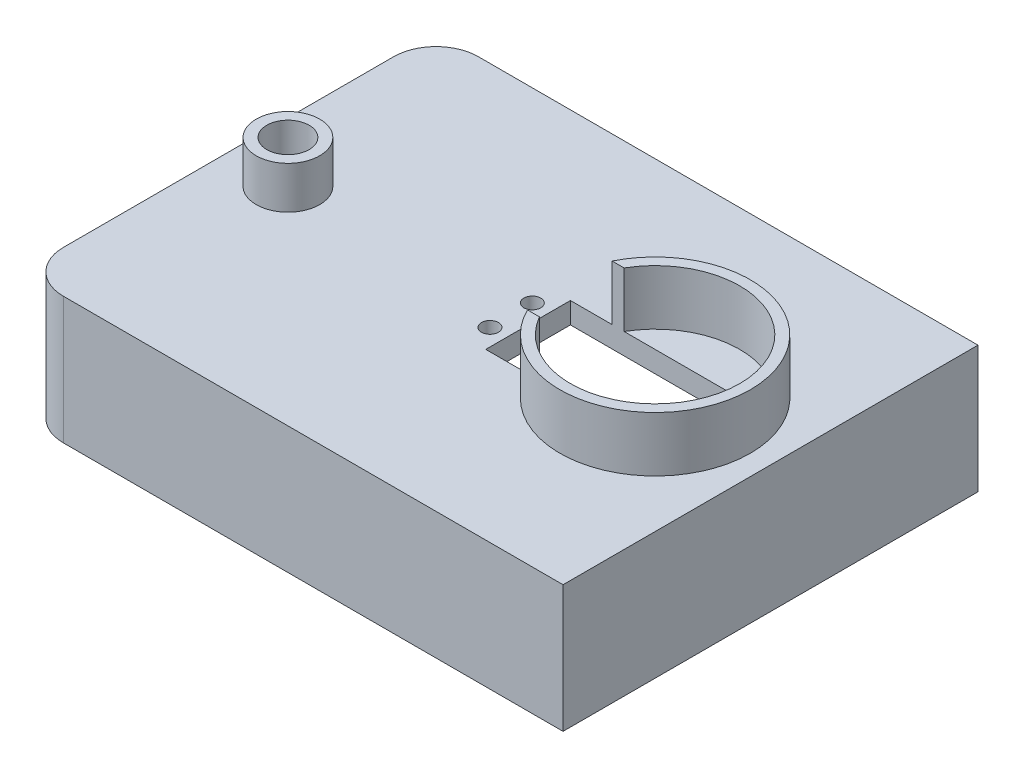
ISO-10303-21;
HEADER;
FILE_DESCRIPTION(('STEP AP214'),'2;1');
FILE_NAME('part.step','',(''),(''),'','','');
FILE_SCHEMA(('AUTOMOTIVE_DESIGN { 1 0 10303 214 1 1 1 1 }'));
ENDSEC;
DATA;
#1=APPLICATION_CONTEXT('core data for automotive mechanical design processes');
#2=APPLICATION_PROTOCOL_DEFINITION('international standard','automotive_design',2000,#1);
#3=PRODUCT_CONTEXT('',#1,'mechanical');
#4=PRODUCT('Part','Part','',(#3));
#5=PRODUCT_RELATED_PRODUCT_CATEGORY('part','',(#4));
#6=PRODUCT_DEFINITION_FORMATION('','',#4);
#7=PRODUCT_DEFINITION_CONTEXT('part definition',#1,'design');
#8=PRODUCT_DEFINITION('design','',#6,#7);
#9=PRODUCT_DEFINITION_SHAPE('','',#8);
#10=(LENGTH_UNIT() NAMED_UNIT(*) SI_UNIT(.MILLI.,.METRE.));
#11=(NAMED_UNIT(*) PLANE_ANGLE_UNIT() SI_UNIT($,.RADIAN.));
#12=(NAMED_UNIT(*) SI_UNIT($,.STERADIAN.) SOLID_ANGLE_UNIT());
#13=UNCERTAINTY_MEASURE_WITH_UNIT(LENGTH_MEASURE(1.E-05),#10,'distance_accuracy_value','');
#14=(GEOMETRIC_REPRESENTATION_CONTEXT(3) GLOBAL_UNCERTAINTY_ASSIGNED_CONTEXT((#13)) GLOBAL_UNIT_ASSIGNED_CONTEXT((#10,
#11,#12)) REPRESENTATION_CONTEXT('',''));
#15=CARTESIAN_POINT('',(0.,0.,0.));
#16=DIRECTION('',(0.,0.,1.));
#17=DIRECTION('',(1.,0.,0.));
#18=AXIS2_PLACEMENT_3D('',#15,#16,#17);
#19=CARTESIAN_POINT('',(0.,30.,0.));
#20=DIRECTION('',(0.,1.,0.));
#21=DIRECTION('',(0.,0.,1.));
#22=AXIS2_PLACEMENT_3D('',#19,#20,#21);
#23=PLANE('',#22);
#24=DIRECTION('',(-1.,0.,0.));
#25=VECTOR('',#24,1.);
#26=CARTESIAN_POINT('',(-64.,30.,-49.));
#27=LINE('',#26,#25);
#28=CARTESIAN_POINT('',(64.,30.,-49.));
#29=VERTEX_POINT('',#28);
#30=CARTESIAN_POINT('',(-54.,30.,-49.));
#31=VERTEX_POINT('',#30);
#32=EDGE_CURVE('E267',#29,#31,#27,.T.);
#33=ORIENTED_EDGE('',*,*,#32,.T.);
#34=CARTESIAN_POINT('',(-54.,30.,-39.));
#35=DIRECTION('',(0.,1.,0.));
#36=DIRECTION('',(0.,0.,1.));
#37=AXIS2_PLACEMENT_3D('',#34,#35,#36);
#38=CIRCLE('',#37,10.);
#39=CARTESIAN_POINT('',(-64.,30.,-39.));
#40=VERTEX_POINT('',#39);
#41=EDGE_CURVE('E52',#31,#40,#38,.T.);
#42=ORIENTED_EDGE('',*,*,#41,.T.);
#43=DIRECTION('',(0.,0.,1.));
#44=VECTOR('',#43,1.);
#45=CARTESIAN_POINT('',(-64.,30.,-49.));
#46=LINE('',#45,#44);
#47=CARTESIAN_POINT('',(-64.,30.,39.));
#48=VERTEX_POINT('',#47);
#49=EDGE_CURVE('E271',#40,#48,#46,.T.);
#50=ORIENTED_EDGE('',*,*,#49,.T.);
#51=CARTESIAN_POINT('',(-54.,30.,39.));
#52=DIRECTION('',(0.,1.,0.));
#53=DIRECTION('',(0.,0.,1.));
#54=AXIS2_PLACEMENT_3D('',#51,#52,#53);
#55=CIRCLE('',#54,10.);
#56=CARTESIAN_POINT('',(-54.,30.,49.));
#57=VERTEX_POINT('',#56);
#58=EDGE_CURVE('E316',#48,#57,#55,.T.);
#59=ORIENTED_EDGE('',*,*,#58,.T.);
#60=DIRECTION('',(1.,0.,0.));
#61=VECTOR('',#60,1.);
#62=CARTESIAN_POINT('',(-64.,30.,49.));
#63=LINE('',#62,#61);
#64=CARTESIAN_POINT('',(64.,30.,49.));
#65=VERTEX_POINT('',#64);
#66=EDGE_CURVE('E274',#57,#65,#63,.T.);
#67=ORIENTED_EDGE('',*,*,#66,.T.);
#68=DIRECTION('',(0.,0.,-1.));
#69=VECTOR('',#68,1.);
#70=CARTESIAN_POINT('',(64.,30.,-49.));
#71=LINE('',#70,#69);
#72=EDGE_CURVE('E264',#65,#29,#71,.T.);
#73=ORIENTED_EDGE('',*,*,#72,.T.);
#74=EDGE_LOOP('',(#33,#42,#50,#59,#67,#73));
#75=FACE_BOUND('',#74,.T.);
#76=CARTESIAN_POINT('',(2.74010104788201,30.,-5.00000000000001));
#77=DIRECTION('',(0.,1.,0.));
#78=DIRECTION('',(0.,0.,1.));
#79=AXIS2_PLACEMENT_3D('',#76,#77,#78);
#80=CIRCLE('',#79,2.);
#81=CARTESIAN_POINT('',(2.74010104788201,30.,-3.00000000000001));
#82=VERTEX_POINT('',#81);
#83=EDGE_CURVE('E197',#82,#82,#80,.T.);
#84=ORIENTED_EDGE('',*,*,#83,.F.);
#85=EDGE_LOOP('',(#84));
#86=FACE_BOUND('',#85,.T.);
#87=CARTESIAN_POINT('',(2.74010104788201,30.,4.99999999999999));
#88=DIRECTION('',(0.,1.,0.));
#89=DIRECTION('',(0.,0.,1.));
#90=AXIS2_PLACEMENT_3D('',#87,#88,#89);
#91=CIRCLE('',#90,2.);
#92=CARTESIAN_POINT('',(2.74010104788201,30.,6.99999999999999));
#93=VERTEX_POINT('',#92);
#94=EDGE_CURVE('E194',#93,#93,#91,.T.);
#95=ORIENTED_EDGE('',*,*,#94,.F.);
#96=EDGE_LOOP('',(#95));
#97=FACE_BOUND('',#96,.T.);
#98=CARTESIAN_POINT('',(36.740101047882,30.,0.));
#99=DIRECTION('',(0.,1.,0.));
#100=DIRECTION('',(0.,0.,1.));
#101=AXIS2_PLACEMENT_3D('',#98,#99,#100);
#102=CIRCLE('',#101,22.5);
#103=CARTESIAN_POINT('',(16.5844566771357,30.,10.));
#104=VERTEX_POINT('',#103);
#105=CARTESIAN_POINT('',(16.5844566771356,30.,-10.));
#106=VERTEX_POINT('',#105);
#107=EDGE_CURVE('E68',#104,#106,#102,.T.);
#108=ORIENTED_EDGE('',*,*,#107,.F.);
#109=DIRECTION('',(1.,0.,0.));
#110=VECTOR('',#109,1.);
#111=CARTESIAN_POINT('',(6.74010104788201,30.,10.));
#112=LINE('',#111,#110);
#113=CARTESIAN_POINT('',(6.74010104788201,30.,10.));
#114=VERTEX_POINT('',#113);
#115=EDGE_CURVE('E215',#114,#104,#112,.T.);
#116=ORIENTED_EDGE('',*,*,#115,.F.);
#117=DIRECTION('',(0.,0.,1.));
#118=VECTOR('',#117,1.);
#119=CARTESIAN_POINT('',(6.74010104788201,30.,-10.));
#120=LINE('',#119,#118);
#121=CARTESIAN_POINT('',(6.74010104788201,30.,-10.));
#122=VERTEX_POINT('',#121);
#123=EDGE_CURVE('E212',#122,#114,#120,.T.);
#124=ORIENTED_EDGE('',*,*,#123,.F.);
#125=DIRECTION('',(-1.,0.,0.));
#126=VECTOR('',#125,1.);
#127=CARTESIAN_POINT('',(6.74010104788201,30.,-10.));
#128=LINE('',#127,#126);
#129=EDGE_CURVE('E220',#106,#122,#128,.T.);
#130=ORIENTED_EDGE('',*,*,#129,.F.);
#131=EDGE_LOOP('',(#108,#116,#124,#130));
#132=FACE_BOUND('',#131,.T.);
#133=CARTESIAN_POINT('',(-49.9721682107591,30.,0.));
#134=DIRECTION('',(0.,1.,0.));
#135=DIRECTION('',(0.,0.,1.));
#136=AXIS2_PLACEMENT_3D('',#133,#134,#135);
#137=CIRCLE('',#136,7.5);
#138=CARTESIAN_POINT('',(-49.9721682107591,30.,7.5));
#139=VERTEX_POINT('',#138);
#140=EDGE_CURVE('E637',#139,#139,#137,.T.);
#141=ORIENTED_EDGE('',*,*,#140,.F.);
#142=EDGE_LOOP('',(#141));
#143=FACE_BOUND('',#142,.T.);
#144=ADVANCED_FACE('F43',(#75,#86,#97,#132,#143),#23,.T.);
#145=CARTESIAN_POINT('',(36.740101047882,30.,0.));
#146=DIRECTION('',(0.,-1.,0.));
#147=DIRECTION('',(0.,0.,1.));
#148=AXIS2_PLACEMENT_3D('',#145,#146,#147);
#149=CIRCLE('',#148,20.);
#150=CARTESIAN_POINT('',(19.4195929721932,30.,-10.));
#151=VERTEX_POINT('',#150);
#152=CARTESIAN_POINT('',(19.4195929721932,30.,10.));
#153=VERTEX_POINT('',#152);
#154=EDGE_CURVE('E193',#151,#153,#149,.T.);
#155=ORIENTED_EDGE('',*,*,#154,.F.);
#156=CARTESIAN_POINT('',(46.740101047882,30.,-10.));
#157=VERTEX_POINT('',#156);
#158=EDGE_CURVE('E221',#157,#151,#128,.T.);
#159=ORIENTED_EDGE('',*,*,#158,.F.);
#160=DIRECTION('',(0.,0.,-1.));
#161=VECTOR('',#160,1.);
#162=CARTESIAN_POINT('',(46.740101047882,30.,-10.));
#163=LINE('',#162,#161);
#164=CARTESIAN_POINT('',(46.740101047882,30.,10.));
#165=VERTEX_POINT('',#164);
#166=EDGE_CURVE('E217',#165,#157,#163,.T.);
#167=ORIENTED_EDGE('',*,*,#166,.F.);
#168=EDGE_CURVE('E60',#153,#165,#112,.T.);
#169=ORIENTED_EDGE('',*,*,#168,.F.);
#170=EDGE_LOOP('',(#155,#159,#167,#169));
#171=FACE_BOUND('',#170,.T.);
#172=CARTESIAN_POINT('',(50.740101047882,30.,4.99999999999999));
#173=DIRECTION('',(0.,1.,0.));
#174=DIRECTION('',(0.,0.,1.));
#175=AXIS2_PLACEMENT_3D('',#172,#173,#174);
#176=CIRCLE('',#175,2.);
#177=CARTESIAN_POINT('',(50.740101047882,30.,6.99999999999999));
#178=VERTEX_POINT('',#177);
#179=EDGE_CURVE('E206',#178,#178,#176,.T.);
#180=ORIENTED_EDGE('',*,*,#179,.F.);
#181=EDGE_LOOP('',(#180));
#182=FACE_BOUND('',#181,.T.);
#183=CARTESIAN_POINT('',(50.740101047882,30.,-5.00000000000001));
#184=DIRECTION('',(0.,1.,0.));
#185=DIRECTION('',(0.,0.,1.));
#186=AXIS2_PLACEMENT_3D('',#183,#184,#185);
#187=CIRCLE('',#186,2.);
#188=CARTESIAN_POINT('',(50.740101047882,30.,-3.));
#189=VERTEX_POINT('',#188);
#190=EDGE_CURVE('E203',#189,#189,#187,.T.);
#191=ORIENTED_EDGE('',*,*,#190,.F.);
#192=EDGE_LOOP('',(#191));
#193=FACE_BOUND('',#192,.T.);
#194=ADVANCED_FACE('F348',(#171,#182,#193),#23,.T.);
#195=CARTESIAN_POINT('',(59.,30.,-44.));
#196=DIRECTION('',(-1.,0.,0.));
#197=DIRECTION('',(0.,0.,1.));
#198=AXIS2_PLACEMENT_3D('',#195,#196,#197);
#199=PLANE('',#198);
#200=DIRECTION('',(0.,-1.,0.));
#201=VECTOR('',#200,1.);
#202=CARTESIAN_POINT('',(59.,30.,44.));
#203=LINE('',#202,#201);
#204=CARTESIAN_POINT('',(59.,25.,44.));
#205=VERTEX_POINT('',#204);
#206=CARTESIAN_POINT('',(59.,0.,44.));
#207=VERTEX_POINT('',#206);
#208=EDGE_CURVE('E255',#205,#207,#203,.T.);
#209=ORIENTED_EDGE('',*,*,#208,.F.);
#210=DIRECTION('',(0.,0.,-1.));
#211=VECTOR('',#210,1.);
#212=CARTESIAN_POINT('',(59.,25.,-44.));
#213=LINE('',#212,#211);
#214=CARTESIAN_POINT('',(59.,25.,-44.));
#215=VERTEX_POINT('',#214);
#216=EDGE_CURVE('E240',#205,#215,#213,.T.);
#217=ORIENTED_EDGE('',*,*,#216,.T.);
#218=DIRECTION('',(0.,-1.,0.));
#219=VECTOR('',#218,1.);
#220=CARTESIAN_POINT('',(59.,30.,-44.));
#221=LINE('',#220,#219);
#222=CARTESIAN_POINT('',(59.,0.,-44.));
#223=VERTEX_POINT('',#222);
#224=EDGE_CURVE('E261',#215,#223,#221,.T.);
#225=ORIENTED_EDGE('',*,*,#224,.T.);
#226=DIRECTION('',(0.,0.,-1.));
#227=VECTOR('',#226,1.);
#228=CARTESIAN_POINT('',(59.,0.,-44.));
#229=LINE('',#228,#227);
#230=EDGE_CURVE('E243',#207,#223,#229,.T.);
#231=ORIENTED_EDGE('',*,*,#230,.F.);
#232=EDGE_LOOP('',(#209,#217,#225,#231));
#233=FACE_BOUND('',#232,.T.);
#234=ADVANCED_FACE('F355',(#233),#199,.T.);
#235=CARTESIAN_POINT('',(-59.,30.,-44.));
#236=DIRECTION('',(0.,0.,1.));
#237=DIRECTION('',(1.,0.,0.));
#238=AXIS2_PLACEMENT_3D('',#235,#236,#237);
#239=PLANE('',#238);
#240=ORIENTED_EDGE('',*,*,#224,.F.);
#241=DIRECTION('',(-1.,0.,0.));
#242=VECTOR('',#241,1.);
#243=CARTESIAN_POINT('',(-59.,25.,-44.));
#244=LINE('',#243,#242);
#245=CARTESIAN_POINT('',(-59.,25.,-44.));
#246=VERTEX_POINT('',#245);
#247=EDGE_CURVE('E237',#215,#246,#244,.T.);
#248=ORIENTED_EDGE('',*,*,#247,.T.);
#249=DIRECTION('',(0.,-1.,0.));
#250=VECTOR('',#249,1.);
#251=CARTESIAN_POINT('',(-59.,30.,-44.));
#252=LINE('',#251,#250);
#253=CARTESIAN_POINT('',(-59.,0.,-44.));
#254=VERTEX_POINT('',#253);
#255=EDGE_CURVE('E259',#246,#254,#252,.T.);
#256=ORIENTED_EDGE('',*,*,#255,.T.);
#257=DIRECTION('',(-1.,0.,0.));
#258=VECTOR('',#257,1.);
#259=CARTESIAN_POINT('',(-59.,0.,-44.));
#260=LINE('',#259,#258);
#261=EDGE_CURVE('E246',#223,#254,#260,.T.);
#262=ORIENTED_EDGE('',*,*,#261,.F.);
#263=EDGE_LOOP('',(#240,#248,#256,#262));
#264=FACE_BOUND('',#263,.T.);
#265=ADVANCED_FACE('F414',(#264),#239,.T.);
#266=CARTESIAN_POINT('',(-59.,30.,-44.));
#267=DIRECTION('',(1.,0.,0.));
#268=DIRECTION('',(0.,0.,-1.));
#269=AXIS2_PLACEMENT_3D('',#266,#267,#268);
#270=PLANE('',#269);
#271=ORIENTED_EDGE('',*,*,#255,.F.);
#272=DIRECTION('',(0.,0.,1.));
#273=VECTOR('',#272,1.);
#274=CARTESIAN_POINT('',(-59.,25.,-44.));
#275=LINE('',#274,#273);
#276=CARTESIAN_POINT('',(-59.,25.,44.));
#277=VERTEX_POINT('',#276);
#278=EDGE_CURVE('E228',#246,#277,#275,.T.);
#279=ORIENTED_EDGE('',*,*,#278,.T.);
#280=DIRECTION('',(0.,-1.,0.));
#281=VECTOR('',#280,1.);
#282=CARTESIAN_POINT('',(-59.,30.,44.));
#283=LINE('',#282,#281);
#284=CARTESIAN_POINT('',(-59.,0.,44.));
#285=VERTEX_POINT('',#284);
#286=EDGE_CURVE('E257',#277,#285,#283,.T.);
#287=ORIENTED_EDGE('',*,*,#286,.T.);
#288=DIRECTION('',(0.,0.,1.));
#289=VECTOR('',#288,1.);
#290=CARTESIAN_POINT('',(-59.,0.,-44.));
#291=LINE('',#290,#289);
#292=EDGE_CURVE('E249',#254,#285,#291,.T.);
#293=ORIENTED_EDGE('',*,*,#292,.F.);
#294=EDGE_LOOP('',(#271,#279,#287,#293));
#295=FACE_BOUND('',#294,.T.);
#296=ADVANCED_FACE('F418',(#295),#270,.T.);
#297=CARTESIAN_POINT('',(-59.,30.,44.));
#298=DIRECTION('',(0.,0.,-1.));
#299=DIRECTION('',(-1.,0.,0.));
#300=AXIS2_PLACEMENT_3D('',#297,#298,#299);
#301=PLANE('',#300);
#302=ORIENTED_EDGE('',*,*,#286,.F.);
#303=DIRECTION('',(1.,0.,0.));
#304=VECTOR('',#303,1.);
#305=CARTESIAN_POINT('',(-59.,25.,44.));
#306=LINE('',#305,#304);
#307=EDGE_CURVE('E290',#277,#205,#306,.T.);
#308=ORIENTED_EDGE('',*,*,#307,.T.);
#309=ORIENTED_EDGE('',*,*,#208,.T.);
#310=DIRECTION('',(1.,0.,0.));
#311=VECTOR('',#310,1.);
#312=CARTESIAN_POINT('',(-59.,0.,44.));
#313=LINE('',#312,#311);
#314=EDGE_CURVE('E252',#285,#207,#313,.T.);
#315=ORIENTED_EDGE('',*,*,#314,.F.);
#316=EDGE_LOOP('',(#302,#308,#309,#315));
#317=FACE_BOUND('',#316,.T.);
#318=ADVANCED_FACE('F364',(#317),#301,.T.);
#319=CARTESIAN_POINT('',(0.,0.,0.));
#320=DIRECTION('',(0.,1.,0.));
#321=DIRECTION('',(0.,0.,1.));
#322=AXIS2_PLACEMENT_3D('',#319,#320,#321);
#323=PLANE('',#322);
#324=DIRECTION('',(0.,0.,1.));
#325=VECTOR('',#324,1.);
#326=CARTESIAN_POINT('',(-64.,0.,-49.));
#327=LINE('',#326,#325);
#328=CARTESIAN_POINT('',(-64.,0.,-39.));
#329=VERTEX_POINT('',#328);
#330=CARTESIAN_POINT('',(-64.,0.,39.));
#331=VERTEX_POINT('',#330);
#332=EDGE_CURVE('E282',#329,#331,#327,.T.);
#333=ORIENTED_EDGE('',*,*,#332,.F.);
#334=CARTESIAN_POINT('',(-54.,0.,-39.));
#335=DIRECTION('',(0.,1.,0.));
#336=DIRECTION('',(0.,0.,1.));
#337=AXIS2_PLACEMENT_3D('',#334,#335,#336);
#338=CIRCLE('',#337,10.);
#339=CARTESIAN_POINT('',(-54.,0.,-49.));
#340=VERTEX_POINT('',#339);
#341=EDGE_CURVE('E312',#329,#340,#338,.F.);
#342=ORIENTED_EDGE('',*,*,#341,.T.);
#343=DIRECTION('',(-1.,0.,0.));
#344=VECTOR('',#343,1.);
#345=CARTESIAN_POINT('',(-64.,0.,-49.));
#346=LINE('',#345,#344);
#347=CARTESIAN_POINT('',(64.,0.,-49.));
#348=VERTEX_POINT('',#347);
#349=EDGE_CURVE('E279',#348,#340,#346,.T.);
#350=ORIENTED_EDGE('',*,*,#349,.F.);
#351=DIRECTION('',(0.,0.,-1.));
#352=VECTOR('',#351,1.);
#353=CARTESIAN_POINT('',(64.,0.,-49.));
#354=LINE('',#353,#352);
#355=CARTESIAN_POINT('',(64.,0.,49.));
#356=VERTEX_POINT('',#355);
#357=EDGE_CURVE('E263',#356,#348,#354,.T.);
#358=ORIENTED_EDGE('',*,*,#357,.F.);
#359=DIRECTION('',(1.,0.,0.));
#360=VECTOR('',#359,1.);
#361=CARTESIAN_POINT('',(-64.,0.,49.));
#362=LINE('',#361,#360);
#363=CARTESIAN_POINT('',(-54.,0.,49.));
#364=VERTEX_POINT('',#363);
#365=EDGE_CURVE('E268',#364,#356,#362,.T.);
#366=ORIENTED_EDGE('',*,*,#365,.F.);
#367=CARTESIAN_POINT('',(-54.,0.,39.));
#368=DIRECTION('',(0.,1.,0.));
#369=DIRECTION('',(0.,0.,1.));
#370=AXIS2_PLACEMENT_3D('',#367,#368,#369);
#371=CIRCLE('',#370,10.);
#372=EDGE_CURVE('E310',#364,#331,#371,.F.);
#373=ORIENTED_EDGE('',*,*,#372,.T.);
#374=EDGE_LOOP('',(#333,#342,#350,#358,#366,#373));
#375=FACE_BOUND('',#374,.T.);
#376=ORIENTED_EDGE('',*,*,#230,.T.);
#377=ORIENTED_EDGE('',*,*,#261,.T.);
#378=ORIENTED_EDGE('',*,*,#292,.T.);
#379=ORIENTED_EDGE('',*,*,#314,.T.);
#380=EDGE_LOOP('',(#376,#377,#378,#379));
#381=FACE_BOUND('',#380,.T.);
#382=ADVANCED_FACE('F360',(#375,#381),#323,.F.);
#383=CARTESIAN_POINT('',(64.,30.,-49.));
#384=DIRECTION('',(-1.,0.,0.));
#385=DIRECTION('',(0.,0.,1.));
#386=AXIS2_PLACEMENT_3D('',#383,#384,#385);
#387=PLANE('',#386);
#388=DIRECTION('',(0.,-1.,0.));
#389=VECTOR('',#388,1.);
#390=CARTESIAN_POINT('',(64.,30.,49.));
#391=LINE('',#390,#389);
#392=EDGE_CURVE('E276',#65,#356,#391,.T.);
#393=ORIENTED_EDGE('',*,*,#392,.T.);
#394=ORIENTED_EDGE('',*,*,#357,.T.);
#395=DIRECTION('',(0.,-1.,0.));
#396=VECTOR('',#395,1.);
#397=CARTESIAN_POINT('',(64.,30.,-49.));
#398=LINE('',#397,#396);
#399=EDGE_CURVE('E288',#29,#348,#398,.T.);
#400=ORIENTED_EDGE('',*,*,#399,.F.);
#401=ORIENTED_EDGE('',*,*,#72,.F.);
#402=EDGE_LOOP('',(#393,#394,#400,#401));
#403=FACE_BOUND('',#402,.T.);
#404=ADVANCED_FACE('F363',(#403),#387,.F.);
#405=CARTESIAN_POINT('',(-64.,30.,-49.));
#406=DIRECTION('',(0.,0.,1.));
#407=DIRECTION('',(1.,0.,0.));
#408=AXIS2_PLACEMENT_3D('',#405,#406,#407);
#409=PLANE('',#408);
#410=ORIENTED_EDGE('',*,*,#349,.T.);
#411=DIRECTION('',(0.,-1.,0.));
#412=VECTOR('',#411,1.);
#413=CARTESIAN_POINT('',(-54.,30.,-49.));
#414=LINE('',#413,#412);
#415=EDGE_CURVE('E314',#340,#31,#414,.F.);
#416=ORIENTED_EDGE('',*,*,#415,.T.);
#417=ORIENTED_EDGE('',*,*,#32,.F.);
#418=ORIENTED_EDGE('',*,*,#399,.T.);
#419=EDGE_LOOP('',(#410,#416,#417,#418));
#420=FACE_BOUND('',#419,.T.);
#421=ADVANCED_FACE('F373',(#420),#409,.F.);
#422=CARTESIAN_POINT('',(-64.,30.,-49.));
#423=DIRECTION('',(1.,0.,0.));
#424=DIRECTION('',(0.,0.,-1.));
#425=AXIS2_PLACEMENT_3D('',#422,#423,#424);
#426=PLANE('',#425);
#427=ORIENTED_EDGE('',*,*,#49,.F.);
#428=DIRECTION('',(0.,-1.,0.));
#429=VECTOR('',#428,1.);
#430=CARTESIAN_POINT('',(-64.,30.,-39.));
#431=LINE('',#430,#429);
#432=EDGE_CURVE('E307',#40,#329,#431,.T.);
#433=ORIENTED_EDGE('',*,*,#432,.T.);
#434=ORIENTED_EDGE('',*,*,#332,.T.);
#435=DIRECTION('',(0.,-1.,0.));
#436=VECTOR('',#435,1.);
#437=CARTESIAN_POINT('',(-64.,30.,39.));
#438=LINE('',#437,#436);
#439=EDGE_CURVE('E305',#331,#48,#438,.F.);
#440=ORIENTED_EDGE('',*,*,#439,.T.);
#441=EDGE_LOOP('',(#427,#433,#434,#440));
#442=FACE_BOUND('',#441,.T.);
#443=ADVANCED_FACE('F369',(#442),#426,.F.);
#444=CARTESIAN_POINT('',(-64.,30.,49.));
#445=DIRECTION('',(0.,0.,-1.));
#446=DIRECTION('',(-1.,0.,0.));
#447=AXIS2_PLACEMENT_3D('',#444,#445,#446);
#448=PLANE('',#447);
#449=ORIENTED_EDGE('',*,*,#66,.F.);
#450=DIRECTION('',(0.,-1.,0.));
#451=VECTOR('',#450,1.);
#452=CARTESIAN_POINT('',(-54.,30.,49.));
#453=LINE('',#452,#451);
#454=EDGE_CURVE('E11',#57,#364,#453,.T.);
#455=ORIENTED_EDGE('',*,*,#454,.T.);
#456=ORIENTED_EDGE('',*,*,#365,.T.);
#457=ORIENTED_EDGE('',*,*,#392,.F.);
#458=EDGE_LOOP('',(#449,#455,#456,#457));
#459=FACE_BOUND('',#458,.T.);
#460=ADVANCED_FACE('F366',(#459),#448,.F.);
#461=CARTESIAN_POINT('',(0.,25.,0.));
#462=DIRECTION('',(0.,1.,0.));
#463=DIRECTION('',(0.,0.,1.));
#464=AXIS2_PLACEMENT_3D('',#461,#462,#463);
#465=PLANE('',#464);
#466=CARTESIAN_POINT('',(-49.9721682107591,25.,0.));
#467=DIRECTION('',(0.,1.,0.));
#468=DIRECTION('',(0.,0.,1.));
#469=AXIS2_PLACEMENT_3D('',#466,#467,#468);
#470=CIRCLE('',#469,5.);
#471=CARTESIAN_POINT('',(-49.9721682107591,25.,5.));
#472=VERTEX_POINT('',#471);
#473=EDGE_CURVE('E47',#472,#472,#470,.T.);
#474=ORIENTED_EDGE('',*,*,#473,.T.);
#475=EDGE_LOOP('',(#474));
#476=FACE_BOUND('',#475,.T.);
#477=CARTESIAN_POINT('',(2.74010104788201,25.,4.99999999999999));
#478=DIRECTION('',(0.,1.,0.));
#479=DIRECTION('',(0.,0.,1.));
#480=AXIS2_PLACEMENT_3D('',#477,#478,#479);
#481=CIRCLE('',#480,2.);
#482=CARTESIAN_POINT('',(2.74010104788201,25.,6.99999999999999));
#483=VERTEX_POINT('',#482);
#484=EDGE_CURVE('E214',#483,#483,#481,.T.);
#485=ORIENTED_EDGE('',*,*,#484,.T.);
#486=EDGE_LOOP('',(#485));
#487=FACE_BOUND('',#486,.T.);
#488=CARTESIAN_POINT('',(2.74010104788201,25.,-5.00000000000001));
#489=DIRECTION('',(0.,1.,0.));
#490=DIRECTION('',(0.,0.,1.));
#491=AXIS2_PLACEMENT_3D('',#488,#489,#490);
#492=CIRCLE('',#491,2.);
#493=CARTESIAN_POINT('',(2.74010104788201,25.,-3.00000000000001));
#494=VERTEX_POINT('',#493);
#495=EDGE_CURVE('E324',#494,#494,#492,.T.);
#496=ORIENTED_EDGE('',*,*,#495,.T.);
#497=EDGE_LOOP('',(#496));
#498=FACE_BOUND('',#497,.T.);
#499=CARTESIAN_POINT('',(50.740101047882,25.,-5.00000000000001));
#500=DIRECTION('',(0.,1.,0.));
#501=DIRECTION('',(0.,0.,1.));
#502=AXIS2_PLACEMENT_3D('',#499,#500,#501);
#503=CIRCLE('',#502,2.);
#504=CARTESIAN_POINT('',(50.740101047882,25.,-3.));
#505=VERTEX_POINT('',#504);
#506=EDGE_CURVE('E321',#505,#505,#503,.T.);
#507=ORIENTED_EDGE('',*,*,#506,.T.);
#508=EDGE_LOOP('',(#507));
#509=FACE_BOUND('',#508,.T.);
#510=CARTESIAN_POINT('',(50.740101047882,25.,4.99999999999999));
#511=DIRECTION('',(0.,1.,0.));
#512=DIRECTION('',(0.,0.,1.));
#513=AXIS2_PLACEMENT_3D('',#510,#511,#512);
#514=CIRCLE('',#513,2.);
#515=CARTESIAN_POINT('',(50.740101047882,25.,6.99999999999999));
#516=VERTEX_POINT('',#515);
#517=EDGE_CURVE('E211',#516,#516,#514,.T.);
#518=ORIENTED_EDGE('',*,*,#517,.T.);
#519=EDGE_LOOP('',(#518));
#520=FACE_BOUND('',#519,.T.);
#521=DIRECTION('',(-1.,0.,0.));
#522=VECTOR('',#521,1.);
#523=CARTESIAN_POINT('',(0.,25.,-10.));
#524=LINE('',#523,#522);
#525=CARTESIAN_POINT('',(46.740101047882,25.,-10.));
#526=VERTEX_POINT('',#525);
#527=CARTESIAN_POINT('',(6.74010104788201,25.,-10.));
#528=VERTEX_POINT('',#527);
#529=EDGE_CURVE('E299',#526,#528,#524,.T.);
#530=ORIENTED_EDGE('',*,*,#529,.T.);
#531=DIRECTION('',(0.,0.,1.));
#532=VECTOR('',#531,1.);
#533=CARTESIAN_POINT('',(6.74010104788201,25.,0.));
#534=LINE('',#533,#532);
#535=CARTESIAN_POINT('',(6.74010104788201,25.,10.));
#536=VERTEX_POINT('',#535);
#537=EDGE_CURVE('E302',#528,#536,#534,.T.);
#538=ORIENTED_EDGE('',*,*,#537,.T.);
#539=DIRECTION('',(1.,0.,0.));
#540=VECTOR('',#539,1.);
#541=CARTESIAN_POINT('',(0.,25.,10.));
#542=LINE('',#541,#540);
#543=CARTESIAN_POINT('',(46.740101047882,25.,10.));
#544=VERTEX_POINT('',#543);
#545=EDGE_CURVE('E293',#536,#544,#542,.T.);
#546=ORIENTED_EDGE('',*,*,#545,.T.);
#547=DIRECTION('',(0.,0.,-1.));
#548=VECTOR('',#547,1.);
#549=CARTESIAN_POINT('',(46.740101047882,25.,0.));
#550=LINE('',#549,#548);
#551=EDGE_CURVE('E296',#544,#526,#550,.T.);
#552=ORIENTED_EDGE('',*,*,#551,.T.);
#553=EDGE_LOOP('',(#530,#538,#546,#552));
#554=FACE_BOUND('',#553,.T.);
#555=ORIENTED_EDGE('',*,*,#216,.F.);
#556=ORIENTED_EDGE('',*,*,#307,.F.);
#557=ORIENTED_EDGE('',*,*,#278,.F.);
#558=ORIENTED_EDGE('',*,*,#247,.F.);
#559=EDGE_LOOP('',(#555,#556,#557,#558));
#560=FACE_BOUND('',#559,.T.);
#561=ADVANCED_FACE('F329',(#476,#487,#498,#509,#520,#554,#560),#465,.F.);
#562=CARTESIAN_POINT('',(6.74010104788201,20.,-10.));
#563=DIRECTION('',(-1.,0.,0.));
#564=DIRECTION('',(0.,0.,1.));
#565=AXIS2_PLACEMENT_3D('',#562,#563,#564);
#566=PLANE('',#565);
#567=DIRECTION('',(0.,1.,0.));
#568=VECTOR('',#567,1.);
#569=CARTESIAN_POINT('',(6.74010104788201,20.,-10.));
#570=LINE('',#569,#568);
#571=EDGE_CURVE('E225',#528,#122,#570,.T.);
#572=ORIENTED_EDGE('',*,*,#571,.T.);
#573=ORIENTED_EDGE('',*,*,#123,.T.);
#574=DIRECTION('',(0.,1.,0.));
#575=VECTOR('',#574,1.);
#576=CARTESIAN_POINT('',(6.74010104788201,20.,10.));
#577=LINE('',#576,#575);
#578=EDGE_CURVE('E224',#536,#114,#577,.T.);
#579=ORIENTED_EDGE('',*,*,#578,.F.);
#580=ORIENTED_EDGE('',*,*,#537,.F.);
#581=EDGE_LOOP('',(#572,#573,#579,#580));
#582=FACE_BOUND('',#581,.T.);
#583=ADVANCED_FACE('F423',(#582),#566,.F.);
#584=CARTESIAN_POINT('',(6.74010104788201,20.,-10.));
#585=DIRECTION('',(0.,0.,-1.));
#586=DIRECTION('',(-1.,0.,0.));
#587=AXIS2_PLACEMENT_3D('',#584,#585,#586);
#588=PLANE('',#587);
#589=DIRECTION('',(0.,1.,0.));
#590=VECTOR('',#589,1.);
#591=CARTESIAN_POINT('',(46.740101047882,20.,-10.));
#592=LINE('',#591,#590);
#593=EDGE_CURVE('E229',#526,#157,#592,.T.);
#594=ORIENTED_EDGE('',*,*,#593,.T.);
#595=ORIENTED_EDGE('',*,*,#158,.T.);
#596=DIRECTION('',(0.,-1.,0.));
#597=VECTOR('',#596,1.);
#598=CARTESIAN_POINT('',(19.4195929721932,43.,-10.));
#599=LINE('',#598,#597);
#600=CARTESIAN_POINT('',(19.4195929721932,43.,-10.));
#601=VERTEX_POINT('',#600);
#602=EDGE_CURVE('E647',#601,#151,#599,.T.);
#603=ORIENTED_EDGE('',*,*,#602,.F.);
#604=DIRECTION('',(1.,0.,0.));
#605=VECTOR('',#604,1.);
#606=CARTESIAN_POINT('',(16.5844566771356,43.,-10.));
#607=LINE('',#606,#605);
#608=CARTESIAN_POINT('',(16.5844566771356,43.,-10.));
#609=VERTEX_POINT('',#608);
#610=EDGE_CURVE('E187',#609,#601,#607,.T.);
#611=ORIENTED_EDGE('',*,*,#610,.F.);
#612=DIRECTION('',(0.,-1.,0.));
#613=VECTOR('',#612,1.);
#614=CARTESIAN_POINT('',(16.5844566771356,43.,-10.));
#615=LINE('',#614,#613);
#616=EDGE_CURVE('E199',#609,#106,#615,.T.);
#617=ORIENTED_EDGE('',*,*,#616,.T.);
#618=ORIENTED_EDGE('',*,*,#129,.T.);
#619=ORIENTED_EDGE('',*,*,#571,.F.);
#620=ORIENTED_EDGE('',*,*,#529,.F.);
#621=EDGE_LOOP('',(#594,#595,#603,#611,#617,#618,#619,#620));
#622=FACE_BOUND('',#621,.T.);
#623=ADVANCED_FACE('F430',(#622),#588,.F.);
#624=CARTESIAN_POINT('',(46.740101047882,20.,-10.));
#625=DIRECTION('',(1.,0.,0.));
#626=DIRECTION('',(0.,0.,-1.));
#627=AXIS2_PLACEMENT_3D('',#624,#625,#626);
#628=PLANE('',#627);
#629=DIRECTION('',(0.,1.,0.));
#630=VECTOR('',#629,1.);
#631=CARTESIAN_POINT('',(46.740101047882,20.,10.));
#632=LINE('',#631,#630);
#633=EDGE_CURVE('E231',#544,#165,#632,.T.);
#634=ORIENTED_EDGE('',*,*,#633,.T.);
#635=ORIENTED_EDGE('',*,*,#166,.T.);
#636=ORIENTED_EDGE('',*,*,#593,.F.);
#637=ORIENTED_EDGE('',*,*,#551,.F.);
#638=EDGE_LOOP('',(#634,#635,#636,#637));
#639=FACE_BOUND('',#638,.T.);
#640=ADVANCED_FACE('F389',(#639),#628,.F.);
#641=CARTESIAN_POINT('',(6.74010104788201,20.,10.));
#642=DIRECTION('',(0.,0.,1.));
#643=DIRECTION('',(1.,0.,0.));
#644=AXIS2_PLACEMENT_3D('',#641,#642,#643);
#645=PLANE('',#644);
#646=ORIENTED_EDGE('',*,*,#578,.T.);
#647=ORIENTED_EDGE('',*,*,#115,.T.);
#648=DIRECTION('',(0.,-1.,0.));
#649=VECTOR('',#648,1.);
#650=CARTESIAN_POINT('',(16.5844566771356,43.,9.99999999999999));
#651=LINE('',#650,#649);
#652=CARTESIAN_POINT('',(16.5844566771356,43.,9.99999999999999));
#653=VERTEX_POINT('',#652);
#654=EDGE_CURVE('E178',#653,#104,#651,.T.);
#655=ORIENTED_EDGE('',*,*,#654,.F.);
#656=DIRECTION('',(-1.,0.,0.));
#657=VECTOR('',#656,1.);
#658=CARTESIAN_POINT('',(16.5844566771357,43.,10.));
#659=LINE('',#658,#657);
#660=CARTESIAN_POINT('',(19.4195929721932,43.,10.));
#661=VERTEX_POINT('',#660);
#662=EDGE_CURVE('E170',#661,#653,#659,.T.);
#663=ORIENTED_EDGE('',*,*,#662,.F.);
#664=DIRECTION('',(0.,-1.,0.));
#665=VECTOR('',#664,1.);
#666=CARTESIAN_POINT('',(19.4195929721932,43.,10.));
#667=LINE('',#666,#665);
#668=EDGE_CURVE('E175',#661,#153,#667,.T.);
#669=ORIENTED_EDGE('',*,*,#668,.T.);
#670=ORIENTED_EDGE('',*,*,#168,.T.);
#671=ORIENTED_EDGE('',*,*,#633,.F.);
#672=ORIENTED_EDGE('',*,*,#545,.F.);
#673=EDGE_LOOP('',(#646,#647,#655,#663,#669,#670,#671,#672));
#674=FACE_BOUND('',#673,.T.);
#675=ADVANCED_FACE('F173',(#674),#645,.F.);
#676=CARTESIAN_POINT('',(-54.,30.,-39.));
#677=DIRECTION('',(0.,-1.,0.));
#678=DIRECTION('',(0.,0.,-1.));
#679=AXIS2_PLACEMENT_3D('',#676,#677,#678);
#680=CYLINDRICAL_SURFACE('',#679,10.);
#681=ORIENTED_EDGE('',*,*,#41,.F.);
#682=ORIENTED_EDGE('',*,*,#415,.F.);
#683=ORIENTED_EDGE('',*,*,#341,.F.);
#684=ORIENTED_EDGE('',*,*,#432,.F.);
#685=EDGE_LOOP('',(#681,#682,#683,#684));
#686=FACE_BOUND('',#685,.T.);
#687=ADVANCED_FACE('F380',(#686),#680,.T.);
#688=CARTESIAN_POINT('',(-54.,30.,39.));
#689=DIRECTION('',(0.,-1.,0.));
#690=DIRECTION('',(0.,0.,-1.));
#691=AXIS2_PLACEMENT_3D('',#688,#689,#690);
#692=CYLINDRICAL_SURFACE('',#691,10.);
#693=ORIENTED_EDGE('',*,*,#58,.F.);
#694=ORIENTED_EDGE('',*,*,#439,.F.);
#695=ORIENTED_EDGE('',*,*,#372,.F.);
#696=ORIENTED_EDGE('',*,*,#454,.F.);
#697=EDGE_LOOP('',(#693,#694,#695,#696));
#698=FACE_BOUND('',#697,.T.);
#699=ADVANCED_FACE('F45',(#698),#692,.T.);
#700=CARTESIAN_POINT('',(50.740101047882,20.,4.99999999999999));
#701=DIRECTION('',(0.,1.,0.));
#702=DIRECTION('',(0.,0.,1.));
#703=AXIS2_PLACEMENT_3D('',#700,#701,#702);
#704=CYLINDRICAL_SURFACE('',#703,2.);
#705=ORIENTED_EDGE('',*,*,#179,.T.);
#706=EDGE_LOOP('',(#705));
#707=FACE_BOUND('',#706,.T.);
#708=ORIENTED_EDGE('',*,*,#517,.F.);
#709=EDGE_LOOP('',(#708));
#710=FACE_BOUND('',#709,.T.);
#711=ADVANCED_FACE('F387',(#707,#710),#704,.F.);
#712=CARTESIAN_POINT('',(50.740101047882,20.,-5.00000000000001));
#713=DIRECTION('',(0.,1.,0.));
#714=DIRECTION('',(0.,0.,1.));
#715=AXIS2_PLACEMENT_3D('',#712,#713,#714);
#716=CYLINDRICAL_SURFACE('',#715,2.);
#717=ORIENTED_EDGE('',*,*,#190,.T.);
#718=EDGE_LOOP('',(#717));
#719=FACE_BOUND('',#718,.T.);
#720=ORIENTED_EDGE('',*,*,#506,.F.);
#721=EDGE_LOOP('',(#720));
#722=FACE_BOUND('',#721,.T.);
#723=ADVANCED_FACE('F343',(#719,#722),#716,.F.);
#724=CARTESIAN_POINT('',(2.74010104788201,20.,-5.00000000000001));
#725=DIRECTION('',(0.,1.,0.));
#726=DIRECTION('',(0.,0.,1.));
#727=AXIS2_PLACEMENT_3D('',#724,#725,#726);
#728=CYLINDRICAL_SURFACE('',#727,2.);
#729=ORIENTED_EDGE('',*,*,#83,.T.);
#730=EDGE_LOOP('',(#729));
#731=FACE_BOUND('',#730,.T.);
#732=ORIENTED_EDGE('',*,*,#495,.F.);
#733=EDGE_LOOP('',(#732));
#734=FACE_BOUND('',#733,.T.);
#735=ADVANCED_FACE('F334',(#731,#734),#728,.F.);
#736=CARTESIAN_POINT('',(2.74010104788201,20.,4.99999999999999));
#737=DIRECTION('',(0.,1.,0.));
#738=DIRECTION('',(0.,0.,1.));
#739=AXIS2_PLACEMENT_3D('',#736,#737,#738);
#740=CYLINDRICAL_SURFACE('',#739,2.);
#741=ORIENTED_EDGE('',*,*,#94,.T.);
#742=EDGE_LOOP('',(#741));
#743=FACE_BOUND('',#742,.T.);
#744=ORIENTED_EDGE('',*,*,#484,.F.);
#745=EDGE_LOOP('',(#744));
#746=FACE_BOUND('',#745,.T.);
#747=ADVANCED_FACE('F332',(#743,#746),#740,.F.);
#748=CARTESIAN_POINT('',(36.740101047882,43.,0.));
#749=DIRECTION('',(0.,-1.,0.));
#750=DIRECTION('',(0.,0.,-1.));
#751=AXIS2_PLACEMENT_3D('',#748,#749,#750);
#752=CYLINDRICAL_SURFACE('',#751,20.);
#753=ORIENTED_EDGE('',*,*,#154,.T.);
#754=ORIENTED_EDGE('',*,*,#668,.F.);
#755=CARTESIAN_POINT('',(36.740101047882,43.,0.));
#756=DIRECTION('',(0.,-1.,0.));
#757=DIRECTION('',(0.,0.,1.));
#758=AXIS2_PLACEMENT_3D('',#755,#756,#757);
#759=CIRCLE('',#758,20.);
#760=EDGE_CURVE('E182',#601,#661,#759,.T.);
#761=ORIENTED_EDGE('',*,*,#760,.F.);
#762=ORIENTED_EDGE('',*,*,#602,.T.);
#763=EDGE_LOOP('',(#753,#754,#761,#762));
#764=FACE_BOUND('',#763,.T.);
#765=ADVANCED_FACE('F192',(#764),#752,.F.);
#766=CARTESIAN_POINT('',(36.740101047882,43.,0.));
#767=DIRECTION('',(0.,-1.,0.));
#768=DIRECTION('',(0.,0.,-1.));
#769=AXIS2_PLACEMENT_3D('',#766,#767,#768);
#770=CYLINDRICAL_SURFACE('',#769,22.5);
#771=ORIENTED_EDGE('',*,*,#107,.T.);
#772=ORIENTED_EDGE('',*,*,#616,.F.);
#773=CARTESIAN_POINT('',(36.740101047882,43.,0.));
#774=DIRECTION('',(0.,1.,0.));
#775=DIRECTION('',(0.,0.,1.));
#776=AXIS2_PLACEMENT_3D('',#773,#774,#775);
#777=CIRCLE('',#776,22.5);
#778=EDGE_CURVE('E181',#653,#609,#777,.T.);
#779=ORIENTED_EDGE('',*,*,#778,.F.);
#780=ORIENTED_EDGE('',*,*,#654,.T.);
#781=EDGE_LOOP('',(#771,#772,#779,#780));
#782=FACE_BOUND('',#781,.T.);
#783=ADVANCED_FACE('F341',(#782),#770,.T.);
#784=CARTESIAN_POINT('',(36.740101047882,43.,0.));
#785=DIRECTION('',(0.,1.,0.));
#786=DIRECTION('',(0.,0.,1.));
#787=AXIS2_PLACEMENT_3D('',#784,#785,#786);
#788=PLANE('',#787);
#789=ORIENTED_EDGE('',*,*,#760,.T.);
#790=ORIENTED_EDGE('',*,*,#662,.T.);
#791=ORIENTED_EDGE('',*,*,#778,.T.);
#792=ORIENTED_EDGE('',*,*,#610,.T.);
#793=EDGE_LOOP('',(#789,#790,#791,#792));
#794=FACE_BOUND('',#793,.T.);
#795=ADVANCED_FACE('F185',(#794),#788,.T.);
#796=CARTESIAN_POINT('',(-49.9721682107591,-30.,0.));
#797=DIRECTION('',(0.,1.,0.));
#798=DIRECTION('',(0.,0.,1.));
#799=AXIS2_PLACEMENT_3D('',#796,#797,#798);
#800=CYLINDRICAL_SURFACE('',#799,5.);
#801=ORIENTED_EDGE('',*,*,#473,.F.);
#802=EDGE_LOOP('',(#801));
#803=FACE_BOUND('',#802,.T.);
#804=CARTESIAN_POINT('',(-49.9721682107591,40.,0.));
#805=DIRECTION('',(0.,1.,0.));
#806=DIRECTION('',(0.,0.,1.));
#807=AXIS2_PLACEMENT_3D('',#804,#805,#806);
#808=CIRCLE('',#807,5.);
#809=CARTESIAN_POINT('',(-49.9721682107591,40.,5.));
#810=VERTEX_POINT('',#809);
#811=EDGE_CURVE('E639',#810,#810,#808,.T.);
#812=ORIENTED_EDGE('',*,*,#811,.T.);
#813=EDGE_LOOP('',(#812));
#814=FACE_BOUND('',#813,.T.);
#815=ADVANCED_FACE('F579',(#803,#814),#800,.F.);
#816=CARTESIAN_POINT('',(-49.9721682107591,40.,0.));
#817=DIRECTION('',(0.,1.,0.));
#818=DIRECTION('',(0.,0.,1.));
#819=AXIS2_PLACEMENT_3D('',#816,#817,#818);
#820=PLANE('',#819);
#821=CARTESIAN_POINT('',(-49.9721682107591,40.,0.));
#822=DIRECTION('',(0.,1.,0.));
#823=DIRECTION('',(0.,0.,1.));
#824=AXIS2_PLACEMENT_3D('',#821,#822,#823);
#825=CIRCLE('',#824,7.5);
#826=CARTESIAN_POINT('',(-49.9721682107591,40.,7.5));
#827=VERTEX_POINT('',#826);
#828=EDGE_CURVE('E634',#827,#827,#825,.T.);
#829=ORIENTED_EDGE('',*,*,#828,.T.);
#830=EDGE_LOOP('',(#829));
#831=FACE_BOUND('',#830,.T.);
#832=ORIENTED_EDGE('',*,*,#811,.F.);
#833=EDGE_LOOP('',(#832));
#834=FACE_BOUND('',#833,.T.);
#835=ADVANCED_FACE('F589',(#831,#834),#820,.T.);
#836=CARTESIAN_POINT('',(-49.9721682107591,40.,0.));
#837=DIRECTION('',(0.,-1.,0.));
#838=DIRECTION('',(0.,0.,-1.));
#839=AXIS2_PLACEMENT_3D('',#836,#837,#838);
#840=CYLINDRICAL_SURFACE('',#839,7.5);
#841=ORIENTED_EDGE('',*,*,#828,.F.);
#842=EDGE_LOOP('',(#841));
#843=FACE_BOUND('',#842,.T.);
#844=ORIENTED_EDGE('',*,*,#140,.T.);
#845=EDGE_LOOP('',(#844));
#846=FACE_BOUND('',#845,.T.);
#847=ADVANCED_FACE('F611',(#843,#846),#840,.T.);
#848=CLOSED_SHELL('',(#144,#194,#234,#265,#296,#318,#382,#404,#421,#443,#460,#561,#583,#623,
#640,#675,#687,#699,#711,#723,#735,#747,#765,#783,#795,#815,#835,#847));
#849=MANIFOLD_SOLID_BREP('B2',#848);
#850=ADVANCED_BREP_SHAPE_REPRESENTATION('',(#18,#849),#14);
#851=SHAPE_DEFINITION_REPRESENTATION(#9,#850);
ENDSEC;
END-ISO-10303-21;
